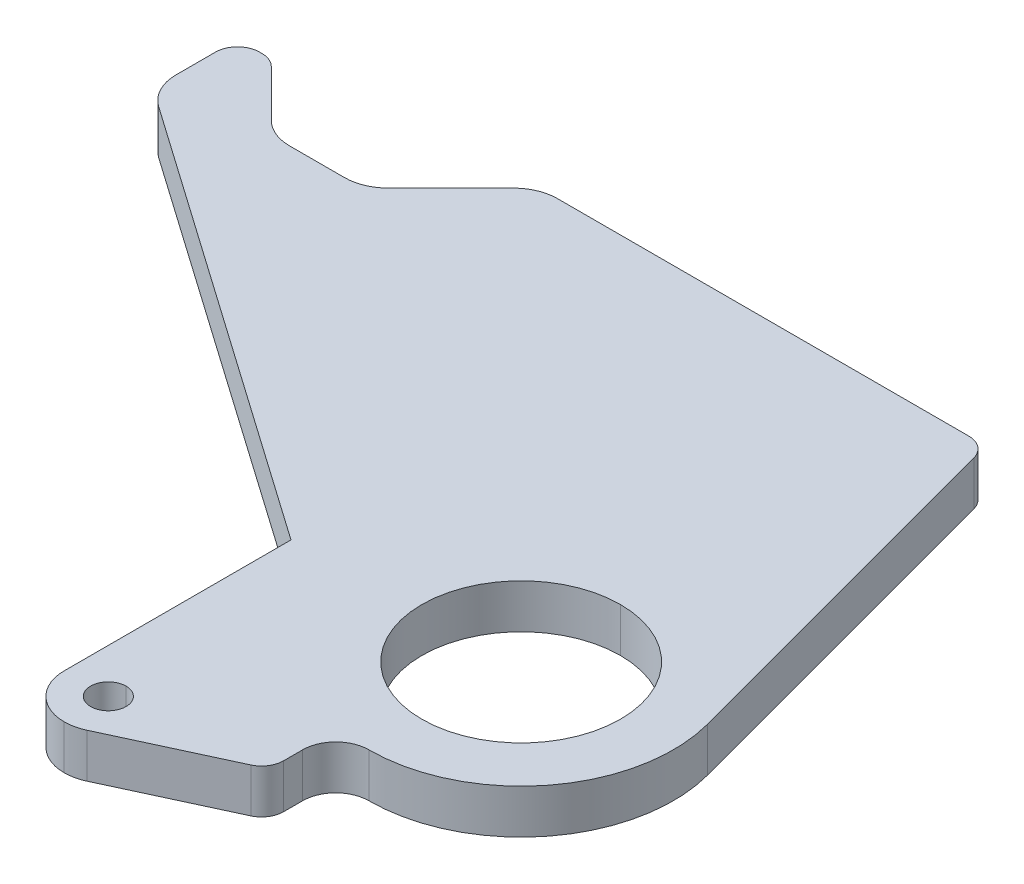
ISO-10303-21;
HEADER;
FILE_DESCRIPTION(('STEP AP214'),'2;1');
FILE_NAME('part.step','',(''),(''),'','','');
FILE_SCHEMA(('AUTOMOTIVE_DESIGN { 1 0 10303 214 1 1 1 1 }'));
ENDSEC;
DATA;
#1=APPLICATION_CONTEXT('core data for automotive mechanical design processes');
#2=APPLICATION_PROTOCOL_DEFINITION('international standard','automotive_design',2000,#1);
#3=PRODUCT_CONTEXT('',#1,'mechanical');
#4=PRODUCT('Part','Part','',(#3));
#5=PRODUCT_RELATED_PRODUCT_CATEGORY('part','',(#4));
#6=PRODUCT_DEFINITION_FORMATION('','',#4);
#7=PRODUCT_DEFINITION_CONTEXT('part definition',#1,'design');
#8=PRODUCT_DEFINITION('design','',#6,#7);
#9=PRODUCT_DEFINITION_SHAPE('','',#8);
#10=(LENGTH_UNIT() NAMED_UNIT(*) SI_UNIT(.MILLI.,.METRE.));
#11=(NAMED_UNIT(*) PLANE_ANGLE_UNIT() SI_UNIT($,.RADIAN.));
#12=(NAMED_UNIT(*) SI_UNIT($,.STERADIAN.) SOLID_ANGLE_UNIT());
#13=UNCERTAINTY_MEASURE_WITH_UNIT(LENGTH_MEASURE(1.E-05),#10,'distance_accuracy_value','');
#14=(GEOMETRIC_REPRESENTATION_CONTEXT(3) GLOBAL_UNCERTAINTY_ASSIGNED_CONTEXT((#13)) GLOBAL_UNIT_ASSIGNED_CONTEXT((#10,
#11,#12)) REPRESENTATION_CONTEXT('',''));
#15=CARTESIAN_POINT('',(0.,0.,0.));
#16=DIRECTION('',(0.,0.,1.));
#17=DIRECTION('',(1.,0.,0.));
#18=AXIS2_PLACEMENT_3D('',#15,#16,#17);
#19=CARTESIAN_POINT('',(-90.6567302270047,-6.35,8.78766007566826));
#20=DIRECTION('',(0.707106781186548,0.,-0.707106781186548));
#21=DIRECTION('',(0.,-1.,0.));
#22=AXIS2_PLACEMENT_3D('',#19,#20,#21);
#23=PLANE('',#22);
#24=DIRECTION('',(-0.707106781186548,0.,-0.707106781186548));
#25=VECTOR('',#24,1.);
#26=CARTESIAN_POINT('',(-90.6567302270047,0.,8.78766007566826));
#27=LINE('',#26,#25);
#28=CARTESIAN_POINT('',(-85.4292622421383,0.,14.0151280605346));
#29=VERTEX_POINT('',#28);
#30=CARTESIAN_POINT('',(-92.1644543329402,0.,7.2799359697327));
#31=VERTEX_POINT('',#30);
#32=EDGE_CURVE('E324',#29,#31,#27,.T.);
#33=ORIENTED_EDGE('',*,*,#32,.F.);
#34=DIRECTION('',(0.,-1.,0.));
#35=VECTOR('',#34,1.);
#36=CARTESIAN_POINT('',(-85.4292622421383,-6.35,14.0151280605346));
#37=LINE('',#36,#35);
#38=CARTESIAN_POINT('',(-85.4292622421383,-6.35,14.0151280605346));
#39=VERTEX_POINT('',#38);
#40=EDGE_CURVE('E351',#29,#39,#37,.T.);
#41=ORIENTED_EDGE('',*,*,#40,.T.);
#42=DIRECTION('',(-0.707106781186548,0.,-0.707106781186548));
#43=VECTOR('',#42,1.);
#44=CARTESIAN_POINT('',(-90.6567302270047,-6.35,8.78766007566826));
#45=LINE('',#44,#43);
#46=CARTESIAN_POINT('',(-92.1644543329402,-6.35,7.2799359697327));
#47=VERTEX_POINT('',#46);
#48=EDGE_CURVE('E221',#39,#47,#45,.T.);
#49=ORIENTED_EDGE('',*,*,#48,.T.);
#50=DIRECTION('',(0.,1.,0.));
#51=VECTOR('',#50,1.);
#52=CARTESIAN_POINT('',(-92.1644543329402,-6.35,7.2799359697327));
#53=LINE('',#52,#51);
#54=EDGE_CURVE('E473',#47,#31,#53,.T.);
#55=ORIENTED_EDGE('',*,*,#54,.T.);
#56=EDGE_LOOP('',(#33,#41,#49,#55));
#57=FACE_BOUND('',#56,.T.);
#58=ADVANCED_FACE('F17',(#57),#23,.T.);
#59=CARTESIAN_POINT('',(-80.2815701513364,-6.35,15.875));
#60=DIRECTION('',(0.,0.,-1.));
#61=DIRECTION('',(0.,-1.,0.));
#62=AXIS2_PLACEMENT_3D('',#59,#60,#61);
#63=PLANE('',#62);
#64=DIRECTION('',(-1.,0.,0.));
#65=VECTOR('',#64,1.);
#66=CARTESIAN_POINT('',(-80.2815701513364,-6.35,15.875));
#67=LINE('',#66,#65);
#68=CARTESIAN_POINT('',(-73.0483658183963,-6.35,15.875));
#69=VERTEX_POINT('',#68);
#70=CARTESIAN_POINT('',(-80.9391341816037,-6.35,15.875));
#71=VERTEX_POINT('',#70);
#72=EDGE_CURVE('E238',#69,#71,#67,.T.);
#73=ORIENTED_EDGE('',*,*,#72,.T.);
#74=DIRECTION('',(0.,1.,0.));
#75=VECTOR('',#74,1.);
#76=CARTESIAN_POINT('',(-80.9391341816037,0.,15.875));
#77=LINE('',#76,#75);
#78=CARTESIAN_POINT('',(-80.9391341816037,0.,15.875));
#79=VERTEX_POINT('',#78);
#80=EDGE_CURVE('E350',#71,#79,#77,.T.);
#81=ORIENTED_EDGE('',*,*,#80,.T.);
#82=DIRECTION('',(-1.,0.,0.));
#83=VECTOR('',#82,1.);
#84=CARTESIAN_POINT('',(-80.2815701513364,0.,15.875));
#85=LINE('',#84,#83);
#86=CARTESIAN_POINT('',(-73.0483658183963,0.,15.875));
#87=VERTEX_POINT('',#86);
#88=EDGE_CURVE('E320',#87,#79,#85,.T.);
#89=ORIENTED_EDGE('',*,*,#88,.F.);
#90=DIRECTION('',(0.,-1.,0.));
#91=VECTOR('',#90,1.);
#92=CARTESIAN_POINT('',(-73.0483658183963,-6.35,15.875));
#93=LINE('',#92,#91);
#94=EDGE_CURVE('E357',#87,#69,#93,.T.);
#95=ORIENTED_EDGE('',*,*,#94,.T.);
#96=EDGE_LOOP('',(#73,#81,#89,#95));
#97=FACE_BOUND('',#96,.T.);
#98=ADVANCED_FACE('F564',(#97),#63,.T.);
#99=CARTESIAN_POINT('',(-68.0932697729954,-6.35,13.5501600756682));
#100=DIRECTION('',(0.707106781186548,0.,0.707106781186547));
#101=DIRECTION('',(0.,-1.,0.));
#102=AXIS2_PLACEMENT_3D('',#99,#100,#101);
#103=PLANE('',#102);
#104=DIRECTION('',(0.707106781186547,0.,-0.707106781186548));
#105=VECTOR('',#104,1.);
#106=CARTESIAN_POINT('',(-68.0932697729954,0.,13.5501600756682));
#107=LINE('',#106,#105);
#108=CARTESIAN_POINT('',(-68.5582377578617,0.,14.0151280605346));
#109=VERTEX_POINT('',#108);
#110=CARTESIAN_POINT('',(-59.5779816367926,0.,5.03487193946542));
#111=VERTEX_POINT('',#110);
#112=EDGE_CURVE('E325',#109,#111,#107,.T.);
#113=ORIENTED_EDGE('',*,*,#112,.T.);
#114=DIRECTION('',(0.,-1.,0.));
#115=VECTOR('',#114,1.);
#116=CARTESIAN_POINT('',(-59.5779816367926,-6.35,5.03487193946542));
#117=LINE('',#116,#115);
#118=CARTESIAN_POINT('',(-59.5779816367926,-6.35,5.03487193946542));
#119=VERTEX_POINT('',#118);
#120=EDGE_CURVE('E417',#111,#119,#117,.T.);
#121=ORIENTED_EDGE('',*,*,#120,.T.);
#122=DIRECTION('',(0.707106781186547,0.,-0.707106781186548));
#123=VECTOR('',#122,1.);
#124=CARTESIAN_POINT('',(-68.0932697729954,-6.35,13.5501600756682));
#125=LINE('',#124,#123);
#126=CARTESIAN_POINT('',(-68.5582377578617,-6.35,14.0151280605346));
#127=VERTEX_POINT('',#126);
#128=EDGE_CURVE('E204',#127,#119,#125,.T.);
#129=ORIENTED_EDGE('',*,*,#128,.F.);
#130=DIRECTION('',(0.,1.,0.));
#131=VECTOR('',#130,1.);
#132=CARTESIAN_POINT('',(-68.5582377578617,-6.35,14.0151280605346));
#133=LINE('',#132,#131);
#134=EDGE_CURVE('E356',#127,#109,#133,.T.);
#135=ORIENTED_EDGE('',*,*,#134,.T.);
#136=EDGE_LOOP('',(#113,#121,#129,#135));
#137=FACE_BOUND('',#136,.T.);
#138=ADVANCED_FACE('F528',(#137),#103,.F.);
#139=CARTESIAN_POINT('',(-25.6009159042003,-6.35,3.175));
#140=DIRECTION('',(0.,0.,-1.));
#141=DIRECTION('',(0.,-1.,0.));
#142=AXIS2_PLACEMENT_3D('',#139,#140,#141);
#143=PLANE('',#142);
#144=DIRECTION('',(-1.,0.,0.));
#145=VECTOR('',#144,1.);
#146=CARTESIAN_POINT('',(-25.6009159042003,-6.35,3.175));
#147=LINE('',#146,#145);
#148=CARTESIAN_POINT('',(4.08001470209326,-6.35,3.175));
#149=VERTEX_POINT('',#148);
#150=CARTESIAN_POINT('',(-55.087853576258,-6.35,3.175));
#151=VERTEX_POINT('',#150);
#152=EDGE_CURVE('E271',#149,#151,#147,.T.);
#153=ORIENTED_EDGE('',*,*,#152,.T.);
#154=DIRECTION('',(0.,1.,0.));
#155=VECTOR('',#154,1.);
#156=CARTESIAN_POINT('',(-55.087853576258,0.,3.175));
#157=LINE('',#156,#155);
#158=CARTESIAN_POINT('',(-55.087853576258,0.,3.175));
#159=VERTEX_POINT('',#158);
#160=EDGE_CURVE('E424',#151,#159,#157,.T.);
#161=ORIENTED_EDGE('',*,*,#160,.T.);
#162=DIRECTION('',(-1.,0.,0.));
#163=VECTOR('',#162,1.);
#164=CARTESIAN_POINT('',(-25.6009159042003,0.,3.175));
#165=LINE('',#164,#163);
#166=CARTESIAN_POINT('',(4.08001470209326,0.,3.175));
#167=VERTEX_POINT('',#166);
#168=EDGE_CURVE('E477',#167,#159,#165,.T.);
#169=ORIENTED_EDGE('',*,*,#168,.F.);
#170=DIRECTION('',(0.,-1.,0.));
#171=VECTOR('',#170,1.);
#172=CARTESIAN_POINT('',(4.08001470209326,-6.35,3.175));
#173=LINE('',#172,#171);
#174=EDGE_CURVE('E430',#167,#149,#173,.T.);
#175=ORIENTED_EDGE('',*,*,#174,.T.);
#176=EDGE_LOOP('',(#153,#161,#169,#175));
#177=FACE_BOUND('',#176,.T.);
#178=ADVANCED_FACE('F523',(#177),#143,.T.);
#179=CARTESIAN_POINT('',(13.8386489641771,-6.35,30.5024608847082));
#180=DIRECTION('',(0.965925826289069,0.,-0.25881904510252));
#181=DIRECTION('',(0.,-1.,0.));
#182=AXIS2_PLACEMENT_3D('',#179,#180,#181);
#183=PLANE('',#182);
#184=DIRECTION('',(-0.25881904510252,0.,-0.965925826289069));
#185=VECTOR('',#184,1.);
#186=CARTESIAN_POINT('',(13.8386489641771,-6.35,30.5024608847082));
#187=LINE('',#186,#185);
#188=CARTESIAN_POINT('',(21.1610200394278,-6.35,57.8299217694165));
#189=VERTEX_POINT('',#188);
#190=CARTESIAN_POINT('',(7.14682920056105,-6.35,5.5282495317995));
#191=VERTEX_POINT('',#190);
#192=EDGE_CURVE('E201',#189,#191,#187,.T.);
#193=ORIENTED_EDGE('',*,*,#192,.T.);
#194=DIRECTION('',(0.,1.,0.));
#195=VECTOR('',#194,1.);
#196=CARTESIAN_POINT('',(7.14682920056105,-6.35,5.5282495317995));
#197=LINE('',#196,#195);
#198=CARTESIAN_POINT('',(7.14682920056105,0.,5.5282495317995));
#199=VERTEX_POINT('',#198);
#200=EDGE_CURVE('E438',#191,#199,#197,.T.);
#201=ORIENTED_EDGE('',*,*,#200,.T.);
#202=DIRECTION('',(-0.25881904510252,0.,-0.965925826289069));
#203=VECTOR('',#202,1.);
#204=CARTESIAN_POINT('',(13.8386489641771,0.,30.5024608847082));
#205=LINE('',#204,#203);
#206=CARTESIAN_POINT('',(21.1610200394278,0.,57.8299217694165));
#207=VERTEX_POINT('',#206);
#208=EDGE_CURVE('E254',#207,#199,#205,.T.);
#209=ORIENTED_EDGE('',*,*,#208,.F.);
#210=DIRECTION('',(0.,1.,0.));
#211=VECTOR('',#210,1.);
#212=CARTESIAN_POINT('',(21.1610200394278,-6.35,57.8299217694165));
#213=LINE('',#212,#211);
#214=EDGE_CURVE('E11',#189,#207,#213,.T.);
#215=ORIENTED_EDGE('',*,*,#214,.F.);
#216=EDGE_LOOP('',(#193,#201,#209,#215));
#217=FACE_BOUND('',#216,.T.);
#218=ADVANCED_FACE('F513',(#217),#183,.T.);
#219=CARTESIAN_POINT('',(0.,-6.35,63.5));
#220=DIRECTION('',(0.,1.,0.));
#221=DIRECTION('',(0.,0.,1.));
#222=AXIS2_PLACEMENT_3D('',#219,#220,#221);
#223=CYLINDRICAL_SURFACE('',#222,21.9075);
#224=CARTESIAN_POINT('',(0.,0.,63.5));
#225=DIRECTION('',(0.,-1.,0.));
#226=DIRECTION('',(0.,0.,-1.));
#227=AXIS2_PLACEMENT_3D('',#224,#225,#226);
#228=CIRCLE('',#227,21.9075);
#229=CARTESIAN_POINT('',(0.,0.,85.4075));
#230=VERTEX_POINT('',#229);
#231=EDGE_CURVE('E258',#207,#230,#228,.T.);
#232=ORIENTED_EDGE('',*,*,#231,.T.);
#233=DIRECTION('',(0.,1.,0.));
#234=VECTOR('',#233,1.);
#235=CARTESIAN_POINT('',(0.,-6.35,85.4075));
#236=LINE('',#235,#234);
#237=CARTESIAN_POINT('',(0.,-6.35,85.4075));
#238=VERTEX_POINT('',#237);
#239=EDGE_CURVE('E27',#238,#230,#236,.T.);
#240=ORIENTED_EDGE('',*,*,#239,.F.);
#241=CARTESIAN_POINT('',(0.,-6.35,63.5));
#242=DIRECTION('',(0.,-1.,0.));
#243=DIRECTION('',(0.,0.,-1.));
#244=AXIS2_PLACEMENT_3D('',#241,#242,#243);
#245=CIRCLE('',#244,21.9075);
#246=EDGE_CURVE('E194',#189,#238,#245,.T.);
#247=ORIENTED_EDGE('',*,*,#246,.F.);
#248=ORIENTED_EDGE('',*,*,#214,.T.);
#249=EDGE_LOOP('',(#232,#240,#247,#248));
#250=FACE_BOUND('',#249,.T.);
#251=ADVANCED_FACE('F511',(#250),#223,.T.);
#252=CARTESIAN_POINT('',(0.,-6.35,90.17));
#253=DIRECTION('',(0.,1.,0.));
#254=DIRECTION('',(0.,0.,1.));
#255=AXIS2_PLACEMENT_3D('',#252,#253,#254);
#256=CYLINDRICAL_SURFACE('',#255,4.7625);
#257=CARTESIAN_POINT('',(0.,0.,90.17));
#258=DIRECTION('',(0.,-1.,0.));
#259=DIRECTION('',(0.,0.,-1.));
#260=AXIS2_PLACEMENT_3D('',#257,#258,#259);
#261=CIRCLE('',#260,4.7625);
#262=CARTESIAN_POINT('',(-4.7625,0.,90.17));
#263=VERTEX_POINT('',#262);
#264=EDGE_CURVE('E175',#263,#230,#261,.T.);
#265=ORIENTED_EDGE('',*,*,#264,.F.);
#266=DIRECTION('',(0.,1.,0.));
#267=VECTOR('',#266,1.);
#268=CARTESIAN_POINT('',(-4.7625,-6.35,90.17));
#269=LINE('',#268,#267);
#270=CARTESIAN_POINT('',(-4.7625,-6.35,90.17));
#271=VERTEX_POINT('',#270);
#272=EDGE_CURVE('E20',#271,#263,#269,.T.);
#273=ORIENTED_EDGE('',*,*,#272,.F.);
#274=CARTESIAN_POINT('',(0.,-6.35,90.17));
#275=DIRECTION('',(0.,-1.,0.));
#276=DIRECTION('',(0.,0.,-1.));
#277=AXIS2_PLACEMENT_3D('',#274,#275,#276);
#278=CIRCLE('',#277,4.7625);
#279=EDGE_CURVE('E172',#271,#238,#278,.T.);
#280=ORIENTED_EDGE('',*,*,#279,.T.);
#281=ORIENTED_EDGE('',*,*,#239,.T.);
#282=EDGE_LOOP('',(#265,#273,#280,#281));
#283=FACE_BOUND('',#282,.T.);
#284=ADVANCED_FACE('F170',(#283),#256,.F.);
#285=CARTESIAN_POINT('',(-4.7625,-6.35,92.55125));
#286=DIRECTION('',(1.,0.,0.));
#287=DIRECTION('',(0.,0.,1.));
#288=AXIS2_PLACEMENT_3D('',#285,#286,#287);
#289=PLANE('',#288);
#290=DIRECTION('',(0.,0.,-1.));
#291=VECTOR('',#290,1.);
#292=CARTESIAN_POINT('',(-4.7625,0.,92.55125));
#293=LINE('',#292,#291);
#294=CARTESIAN_POINT('',(-4.7625,0.,92.9032270908187));
#295=VERTEX_POINT('',#294);
#296=EDGE_CURVE('E499',#295,#263,#293,.T.);
#297=ORIENTED_EDGE('',*,*,#296,.F.);
#298=DIRECTION('',(0.,-1.,0.));
#299=VECTOR('',#298,1.);
#300=CARTESIAN_POINT('',(-4.7625,-6.35,92.9032270908187));
#301=LINE('',#300,#299);
#302=CARTESIAN_POINT('',(-4.7625,-6.35,92.9032270908187));
#303=VERTEX_POINT('',#302);
#304=EDGE_CURVE('E184',#295,#303,#301,.T.);
#305=ORIENTED_EDGE('',*,*,#304,.T.);
#306=DIRECTION('',(0.,0.,-1.));
#307=VECTOR('',#306,1.);
#308=CARTESIAN_POINT('',(-4.7625,-6.35,92.55125));
#309=LINE('',#308,#307);
#310=EDGE_CURVE('E181',#303,#271,#309,.T.);
#311=ORIENTED_EDGE('',*,*,#310,.T.);
#312=ORIENTED_EDGE('',*,*,#272,.T.);
#313=EDGE_LOOP('',(#297,#305,#311,#312));
#314=FACE_BOUND('',#313,.T.);
#315=ADVANCED_FACE('F182',(#314),#289,.T.);
#316=CARTESIAN_POINT('',(-13.7479119919635,-6.35,99.09031399532));
#317=DIRECTION('',(-0.419948978909134,0.,-0.907547715061404));
#318=DIRECTION('',(-0.907547715061404,0.,0.419948978909134));
#319=AXIS2_PLACEMENT_3D('',#316,#317,#318);
#320=PLANE('',#319);
#321=DIRECTION('',(-0.907547715061404,0.,0.419948978909134));
#322=VECTOR('',#321,1.);
#323=CARTESIAN_POINT('',(-13.7479119919635,-6.35,99.09031399532));
#324=LINE('',#323,#322);
#325=CARTESIAN_POINT('',(-6.6041619919635,-6.35,95.7846910861387));
#326=VERTEX_POINT('',#325);
#327=CARTESIAN_POINT('',(-22.733323983927,-6.35,103.24812799064));
#328=VERTEX_POINT('',#327);
#329=EDGE_CURVE('E189',#326,#328,#324,.T.);
#330=ORIENTED_EDGE('',*,*,#329,.F.);
#331=DIRECTION('',(0.,1.,0.));
#332=VECTOR('',#331,1.);
#333=CARTESIAN_POINT('',(-6.6041619919635,0.,95.7846910861387));
#334=LINE('',#333,#332);
#335=CARTESIAN_POINT('',(-6.6041619919635,0.,95.7846910861387));
#336=VERTEX_POINT('',#335);
#337=EDGE_CURVE('E453',#326,#336,#334,.T.);
#338=ORIENTED_EDGE('',*,*,#337,.T.);
#339=DIRECTION('',(-0.907547715061404,0.,0.419948978909134));
#340=VECTOR('',#339,1.);
#341=CARTESIAN_POINT('',(-13.7479119919635,0.,99.09031399532));
#342=LINE('',#341,#340);
#343=CARTESIAN_POINT('',(-22.733323983927,0.,103.24812799064));
#344=VERTEX_POINT('',#343);
#345=EDGE_CURVE('E496',#336,#344,#342,.T.);
#346=ORIENTED_EDGE('',*,*,#345,.T.);
#347=DIRECTION('',(0.,1.,0.));
#348=VECTOR('',#347,1.);
#349=CARTESIAN_POINT('',(-22.733323983927,-6.35,103.24812799064));
#350=LINE('',#349,#348);
#351=EDGE_CURVE('E179',#328,#344,#350,.T.);
#352=ORIENTED_EDGE('',*,*,#351,.F.);
#353=EDGE_LOOP('',(#330,#338,#346,#352));
#354=FACE_BOUND('',#353,.T.);
#355=ADVANCED_FACE('F732',(#354),#320,.F.);
#356=CARTESIAN_POINT('',(-25.4,-6.35,97.4852));
#357=DIRECTION('',(0.,1.,0.));
#358=DIRECTION('',(0.,0.,1.));
#359=AXIS2_PLACEMENT_3D('',#356,#357,#358);
#360=CYLINDRICAL_SURFACE('',#359,6.35);
#361=DIRECTION('',(0.,1.,0.));
#362=VECTOR('',#361,1.);
#363=CARTESIAN_POINT('',(-25.4,-6.35,103.8352));
#364=LINE('',#363,#362);
#365=CARTESIAN_POINT('',(-25.4,-6.35,103.8352));
#366=VERTEX_POINT('',#365);
#367=CARTESIAN_POINT('',(-25.4,0.,103.8352));
#368=VERTEX_POINT('',#367);
#369=EDGE_CURVE('E301',#366,#368,#364,.T.);
#370=ORIENTED_EDGE('',*,*,#369,.F.);
#371=CARTESIAN_POINT('',(-25.4,-6.35,97.4852));
#372=DIRECTION('',(0.,-1.,0.));
#373=DIRECTION('',(0.,0.,-1.));
#374=AXIS2_PLACEMENT_3D('',#371,#372,#373);
#375=CIRCLE('',#374,6.35);
#376=EDGE_CURVE('E210',#328,#366,#375,.T.);
#377=ORIENTED_EDGE('',*,*,#376,.F.);
#378=ORIENTED_EDGE('',*,*,#351,.T.);
#379=CARTESIAN_POINT('',(-25.4,0.,97.4852));
#380=DIRECTION('',(0.,-1.,0.));
#381=DIRECTION('',(0.,0.,-1.));
#382=AXIS2_PLACEMENT_3D('',#379,#380,#381);
#383=CIRCLE('',#382,6.35);
#384=EDGE_CURVE('E294',#344,#368,#383,.T.);
#385=ORIENTED_EDGE('',*,*,#384,.T.);
#386=EDGE_LOOP('',(#370,#377,#378,#385));
#387=FACE_BOUND('',#386,.T.);
#388=ADVANCED_FACE('F742',(#387),#360,.T.);
#389=CARTESIAN_POINT('',(-31.75,-6.35,81.1722638576814));
#390=DIRECTION('',(1.,0.,0.));
#391=DIRECTION('',(0.,0.,1.));
#392=AXIS2_PLACEMENT_3D('',#389,#390,#391);
#393=PLANE('',#392);
#394=DIRECTION('',(0.,0.,-1.));
#395=VECTOR('',#394,1.);
#396=CARTESIAN_POINT('',(-31.75,0.,81.1722638576814));
#397=LINE('',#396,#395);
#398=CARTESIAN_POINT('',(-31.75,0.,97.4852));
#399=VERTEX_POINT('',#398);
#400=CARTESIAN_POINT('',(-31.75,0.,64.8593277153627));
#401=VERTEX_POINT('',#400);
#402=EDGE_CURVE('E291',#399,#401,#397,.T.);
#403=ORIENTED_EDGE('',*,*,#402,.T.);
#404=DIRECTION('',(0.,1.,0.));
#405=VECTOR('',#404,1.);
#406=CARTESIAN_POINT('',(-31.75,-6.35,64.8593277153627));
#407=LINE('',#406,#405);
#408=CARTESIAN_POINT('',(-31.75,-6.35,64.8593277153627));
#409=VERTEX_POINT('',#408);
#410=EDGE_CURVE('E41',#409,#401,#407,.T.);
#411=ORIENTED_EDGE('',*,*,#410,.F.);
#412=DIRECTION('',(0.,0.,-1.));
#413=VECTOR('',#412,1.);
#414=CARTESIAN_POINT('',(-31.75,-6.35,81.1722638576814));
#415=LINE('',#414,#413);
#416=CARTESIAN_POINT('',(-31.75,-6.35,97.4852));
#417=VERTEX_POINT('',#416);
#418=EDGE_CURVE('E214',#417,#409,#415,.T.);
#419=ORIENTED_EDGE('',*,*,#418,.F.);
#420=DIRECTION('',(0.,1.,0.));
#421=VECTOR('',#420,1.);
#422=CARTESIAN_POINT('',(-31.75,-6.35,97.4852));
#423=LINE('',#422,#421);
#424=EDGE_CURVE('E300',#417,#399,#423,.T.);
#425=ORIENTED_EDGE('',*,*,#424,.T.);
#426=EDGE_LOOP('',(#403,#411,#419,#425));
#427=FACE_BOUND('',#426,.T.);
#428=ADVANCED_FACE('F753',(#427),#393,.F.);
#429=CARTESIAN_POINT('',(-64.849375,-6.35,41.6828958303327));
#430=DIRECTION('',(-0.573576436351047,0.,0.819152044288992));
#431=DIRECTION('',(0.,1.,0.));
#432=AXIS2_PLACEMENT_3D('',#429,#430,#431);
#433=PLANE('',#432);
#434=DIRECTION('',(0.819152044288992,0.,0.573576436351047));
#435=VECTOR('',#434,1.);
#436=CARTESIAN_POINT('',(-64.849375,0.,41.6828958303327));
#437=LINE('',#436,#435);
#438=CARTESIAN_POINT('',(-95.2409603708292,0.,20.4024786555341));
#439=VERTEX_POINT('',#438);
#440=EDGE_CURVE('E295',#439,#401,#437,.T.);
#441=ORIENTED_EDGE('',*,*,#440,.F.);
#442=DIRECTION('',(0.,-1.,0.));
#443=VECTOR('',#442,1.);
#444=CARTESIAN_POINT('',(-95.2409603708292,-6.35,20.4024786555341));
#445=LINE('',#444,#443);
#446=CARTESIAN_POINT('',(-95.2409603708292,-6.35,20.4024786555341));
#447=VERTEX_POINT('',#446);
#448=EDGE_CURVE('E406',#439,#447,#445,.T.);
#449=ORIENTED_EDGE('',*,*,#448,.T.);
#450=DIRECTION('',(0.819152044288992,0.,0.573576436351047));
#451=VECTOR('',#450,1.);
#452=CARTESIAN_POINT('',(-64.849375,-6.35,41.6828958303327));
#453=LINE('',#452,#451);
#454=EDGE_CURVE('E215',#447,#409,#453,.T.);
#455=ORIENTED_EDGE('',*,*,#454,.T.);
#456=ORIENTED_EDGE('',*,*,#410,.T.);
#457=EDGE_LOOP('',(#441,#449,#455,#456));
#458=FACE_BOUND('',#457,.T.);
#459=ADVANCED_FACE('F764',(#458),#433,.T.);
#460=CARTESIAN_POINT('',(-97.94875,-6.35,12.4282319726513));
#461=DIRECTION('',(-1.,0.,0.));
#462=DIRECTION('',(0.,0.,1.));
#463=AXIS2_PLACEMENT_3D('',#460,#461,#462);
#464=PLANE('',#463);
#465=DIRECTION('',(0.,0.,1.));
#466=VECTOR('',#465,1.);
#467=CARTESIAN_POINT('',(-97.94875,-6.35,12.4282319726513));
#468=LINE('',#467,#466);
#469=CARTESIAN_POINT('',(-97.94875,-6.35,9.525));
#470=VERTEX_POINT('',#469);
#471=CARTESIAN_POINT('',(-97.94875,-6.35,15.2008631742991));
#472=VERTEX_POINT('',#471);
#473=EDGE_CURVE('E218',#470,#472,#468,.T.);
#474=ORIENTED_EDGE('',*,*,#473,.T.);
#475=DIRECTION('',(0.,1.,0.));
#476=VECTOR('',#475,1.);
#477=CARTESIAN_POINT('',(-97.94875,-6.35,15.2008631742991));
#478=LINE('',#477,#476);
#479=CARTESIAN_POINT('',(-97.94875,0.,15.2008631742991));
#480=VERTEX_POINT('',#479);
#481=EDGE_CURVE('E311',#472,#480,#478,.T.);
#482=ORIENTED_EDGE('',*,*,#481,.T.);
#483=DIRECTION('',(0.,0.,1.));
#484=VECTOR('',#483,1.);
#485=CARTESIAN_POINT('',(-97.94875,0.,12.4282319726513));
#486=LINE('',#485,#484);
#487=CARTESIAN_POINT('',(-97.94875,0.,9.525));
#488=VERTEX_POINT('',#487);
#489=EDGE_CURVE('E487',#488,#480,#486,.T.);
#490=ORIENTED_EDGE('',*,*,#489,.F.);
#491=DIRECTION('',(0.,-1.,0.));
#492=VECTOR('',#491,1.);
#493=CARTESIAN_POINT('',(-97.94875,-6.35,9.525));
#494=LINE('',#493,#492);
#495=EDGE_CURVE('E395',#488,#470,#494,.T.);
#496=ORIENTED_EDGE('',*,*,#495,.T.);
#497=EDGE_LOOP('',(#474,#482,#490,#496));
#498=FACE_BOUND('',#497,.T.);
#499=ADVANCED_FACE('F774',(#498),#464,.T.);
#500=CARTESIAN_POINT('',(0.,-6.35,63.5));
#501=DIRECTION('',(0.,1.,0.));
#502=DIRECTION('',(0.,0.,1.));
#503=AXIS2_PLACEMENT_3D('',#500,#501,#502);
#504=CYLINDRICAL_SURFACE('',#503,14.2875);
#505=DIRECTION('',(0.,1.,0.));
#506=VECTOR('',#505,1.);
#507=CARTESIAN_POINT('',(0.,-6.35,49.2125));
#508=LINE('',#507,#506);
#509=CARTESIAN_POINT('',(0.,-6.35,49.2125));
#510=VERTEX_POINT('',#509);
#511=CARTESIAN_POINT('',(0.,0.,49.2125));
#512=VERTEX_POINT('',#511);
#513=EDGE_CURVE('E290',#510,#512,#508,.T.);
#514=ORIENTED_EDGE('',*,*,#513,.F.);
#515=CARTESIAN_POINT('',(0.,-6.35,63.5));
#516=DIRECTION('',(0.,-1.,0.));
#517=DIRECTION('',(0.,0.,-1.));
#518=AXIS2_PLACEMENT_3D('',#515,#516,#517);
#519=CIRCLE('',#518,14.2875);
#520=CARTESIAN_POINT('',(0.,-6.35,77.7875));
#521=VERTEX_POINT('',#520);
#522=EDGE_CURVE('E222',#510,#521,#519,.T.);
#523=ORIENTED_EDGE('',*,*,#522,.T.);
#524=DIRECTION('',(0.,1.,0.));
#525=VECTOR('',#524,1.);
#526=CARTESIAN_POINT('',(0.,-6.35,77.7875));
#527=LINE('',#526,#525);
#528=CARTESIAN_POINT('',(0.,0.,77.7875));
#529=VERTEX_POINT('',#528);
#530=EDGE_CURVE('E339',#521,#529,#527,.T.);
#531=ORIENTED_EDGE('',*,*,#530,.T.);
#532=CARTESIAN_POINT('',(0.,0.,63.5));
#533=DIRECTION('',(0.,-1.,0.));
#534=DIRECTION('',(0.,0.,-1.));
#535=AXIS2_PLACEMENT_3D('',#532,#533,#534);
#536=CIRCLE('',#535,14.2875);
#537=EDGE_CURVE('E261',#512,#529,#536,.T.);
#538=ORIENTED_EDGE('',*,*,#537,.F.);
#539=EDGE_LOOP('',(#514,#523,#531,#538));
#540=FACE_BOUND('',#539,.T.);
#541=ADVANCED_FACE('F785',(#540),#504,.F.);
#542=CARTESIAN_POINT('',(-95.5215701513364,-6.35,6.35));
#543=DIRECTION('',(0.,0.,-1.));
#544=DIRECTION('',(-1.,0.,0.));
#545=AXIS2_PLACEMENT_3D('',#542,#543,#544);
#546=PLANE('',#545);
#547=DIRECTION('',(-1.,0.,0.));
#548=VECTOR('',#547,1.);
#549=CARTESIAN_POINT('',(-95.5215701513364,0.,6.35));
#550=LINE('',#549,#548);
#551=CARTESIAN_POINT('',(-94.4095183632075,0.,6.35));
#552=VERTEX_POINT('',#551);
#553=CARTESIAN_POINT('',(-94.77375,0.,6.35));
#554=VERTEX_POINT('',#553);
#555=EDGE_CURVE('E484',#552,#554,#550,.T.);
#556=ORIENTED_EDGE('',*,*,#555,.F.);
#557=DIRECTION('',(0.,-1.,0.));
#558=VECTOR('',#557,1.);
#559=CARTESIAN_POINT('',(-94.4095183632075,-6.35,6.35));
#560=LINE('',#559,#558);
#561=CARTESIAN_POINT('',(-94.4095183632075,-6.35,6.35));
#562=VERTEX_POINT('',#561);
#563=EDGE_CURVE('E330',#552,#562,#560,.T.);
#564=ORIENTED_EDGE('',*,*,#563,.T.);
#565=DIRECTION('',(-1.,0.,0.));
#566=VECTOR('',#565,1.);
#567=CARTESIAN_POINT('',(-95.5215701513364,-6.35,6.35));
#568=LINE('',#567,#566);
#569=CARTESIAN_POINT('',(-94.77375,-6.35,6.35));
#570=VERTEX_POINT('',#569);
#571=EDGE_CURVE('E219',#562,#570,#568,.T.);
#572=ORIENTED_EDGE('',*,*,#571,.T.);
#573=DIRECTION('',(0.,1.,0.));
#574=VECTOR('',#573,1.);
#575=CARTESIAN_POINT('',(-94.77375,-6.35,6.35));
#576=LINE('',#575,#574);
#577=EDGE_CURVE('E394',#570,#554,#576,.T.);
#578=ORIENTED_EDGE('',*,*,#577,.T.);
#579=EDGE_LOOP('',(#556,#564,#572,#578));
#580=FACE_BOUND('',#579,.T.);
#581=ADVANCED_FACE('F579',(#580),#546,.T.);
#582=CARTESIAN_POINT('',(-25.4,-6.35,97.4852));
#583=DIRECTION('',(0.,1.,0.));
#584=DIRECTION('',(0.,0.,1.));
#585=AXIS2_PLACEMENT_3D('',#582,#583,#584);
#586=CYLINDRICAL_SURFACE('',#585,2.5527);
#587=DIRECTION('',(0.,1.,0.));
#588=VECTOR('',#587,1.);
#589=CARTESIAN_POINT('',(-25.4,-6.35,94.9325));
#590=LINE('',#589,#588);
#591=CARTESIAN_POINT('',(-25.4,-6.35,94.9325));
#592=VERTEX_POINT('',#591);
#593=CARTESIAN_POINT('',(-25.4,0.,94.9325));
#594=VERTEX_POINT('',#593);
#595=EDGE_CURVE('E361',#592,#594,#590,.T.);
#596=ORIENTED_EDGE('',*,*,#595,.F.);
#597=CARTESIAN_POINT('',(-25.4,-6.35,97.4852));
#598=DIRECTION('',(0.,-1.,0.));
#599=DIRECTION('',(0.,0.,-1.));
#600=AXIS2_PLACEMENT_3D('',#597,#598,#599);
#601=CIRCLE('',#600,2.5527);
#602=CARTESIAN_POINT('',(-25.4,-6.35,100.0379));
#603=VERTEX_POINT('',#602);
#604=EDGE_CURVE('E225',#592,#603,#601,.T.);
#605=ORIENTED_EDGE('',*,*,#604,.T.);
#606=DIRECTION('',(0.,1.,0.));
#607=VECTOR('',#606,1.);
#608=CARTESIAN_POINT('',(-25.4,-6.35,100.0379));
#609=LINE('',#608,#607);
#610=CARTESIAN_POINT('',(-25.4,0.,100.0379));
#611=VERTEX_POINT('',#610);
#612=EDGE_CURVE('E373',#603,#611,#609,.T.);
#613=ORIENTED_EDGE('',*,*,#612,.T.);
#614=CARTESIAN_POINT('',(-25.4,0.,97.4852));
#615=DIRECTION('',(0.,-1.,0.));
#616=DIRECTION('',(0.,0.,-1.));
#617=AXIS2_PLACEMENT_3D('',#614,#615,#616);
#618=CIRCLE('',#617,2.5527);
#619=EDGE_CURVE('E257',#594,#611,#618,.T.);
#620=ORIENTED_EDGE('',*,*,#619,.F.);
#621=EDGE_LOOP('',(#596,#605,#613,#620));
#622=FACE_BOUND('',#621,.T.);
#623=ADVANCED_FACE('F802',(#622),#586,.F.);
#624=CARTESIAN_POINT('',(-2.54,-6.35,48.1696344730925));
#625=DIRECTION('',(0.,-1.,0.));
#626=DIRECTION('',(0.,0.,-1.));
#627=AXIS2_PLACEMENT_3D('',#624,#625,#626);
#628=PLANE('',#627);
#629=CARTESIAN_POINT('',(0.,-6.35,63.5));
#630=DIRECTION('',(0.,-1.,0.));
#631=DIRECTION('',(0.,0.,-1.));
#632=AXIS2_PLACEMENT_3D('',#629,#630,#631);
#633=CIRCLE('',#632,14.2875);
#634=EDGE_CURVE('E329',#521,#510,#633,.T.);
#635=ORIENTED_EDGE('',*,*,#634,.F.);
#636=ORIENTED_EDGE('',*,*,#522,.F.);
#637=EDGE_LOOP('',(#635,#636));
#638=FACE_BOUND('',#637,.T.);
#639=CARTESIAN_POINT('',(-25.4,-6.35,97.4852));
#640=DIRECTION('',(0.,-1.,0.));
#641=DIRECTION('',(0.,0.,-1.));
#642=AXIS2_PLACEMENT_3D('',#639,#640,#641);
#643=CIRCLE('',#642,2.5527);
#644=EDGE_CURVE('E342',#603,#592,#643,.T.);
#645=ORIENTED_EDGE('',*,*,#644,.F.);
#646=ORIENTED_EDGE('',*,*,#604,.F.);
#647=EDGE_LOOP('',(#645,#646));
#648=FACE_BOUND('',#647,.T.);
#649=ORIENTED_EDGE('',*,*,#128,.T.);
#650=CARTESIAN_POINT('',(-55.087853576258,-6.35,9.525));
#651=DIRECTION('',(0.,-1.,0.));
#652=DIRECTION('',(0.,0.,-1.));
#653=AXIS2_PLACEMENT_3D('',#650,#651,#652);
#654=CIRCLE('',#653,6.35);
#655=EDGE_CURVE('E315',#119,#151,#654,.T.);
#656=ORIENTED_EDGE('',*,*,#655,.T.);
#657=ORIENTED_EDGE('',*,*,#152,.F.);
#658=CARTESIAN_POINT('',(4.08001470209326,-6.35,6.35));
#659=DIRECTION('',(0.,-1.,0.));
#660=DIRECTION('',(0.,0.,-1.));
#661=AXIS2_PLACEMENT_3D('',#658,#659,#660);
#662=CIRCLE('',#661,3.175);
#663=EDGE_CURVE('E427',#149,#191,#662,.T.);
#664=ORIENTED_EDGE('',*,*,#663,.T.);
#665=ORIENTED_EDGE('',*,*,#192,.F.);
#666=ORIENTED_EDGE('',*,*,#246,.T.);
#667=ORIENTED_EDGE('',*,*,#279,.F.);
#668=ORIENTED_EDGE('',*,*,#310,.F.);
#669=CARTESIAN_POINT('',(-7.9375,-6.35,92.9032270908187));
#670=DIRECTION('',(0.,-1.,0.));
#671=DIRECTION('',(0.,0.,-1.));
#672=AXIS2_PLACEMENT_3D('',#669,#670,#671);
#673=CIRCLE('',#672,3.175);
#674=EDGE_CURVE('E442',#303,#326,#673,.T.);
#675=ORIENTED_EDGE('',*,*,#674,.T.);
#676=ORIENTED_EDGE('',*,*,#329,.T.);
#677=ORIENTED_EDGE('',*,*,#376,.T.);
#678=CARTESIAN_POINT('',(-25.4,-6.35,97.4852));
#679=DIRECTION('',(0.,-1.,0.));
#680=DIRECTION('',(0.,0.,-1.));
#681=AXIS2_PLACEMENT_3D('',#678,#679,#680);
#682=CIRCLE('',#681,6.35);
#683=EDGE_CURVE('E304',#366,#417,#682,.T.);
#684=ORIENTED_EDGE('',*,*,#683,.T.);
#685=ORIENTED_EDGE('',*,*,#418,.T.);
#686=ORIENTED_EDGE('',*,*,#454,.F.);
#687=CARTESIAN_POINT('',(-91.59875,-6.35,15.2008631742991));
#688=DIRECTION('',(0.,-1.,0.));
#689=DIRECTION('',(0.,0.,-1.));
#690=AXIS2_PLACEMENT_3D('',#687,#688,#689);
#691=CIRCLE('',#690,6.35);
#692=EDGE_CURVE('E399',#447,#472,#691,.T.);
#693=ORIENTED_EDGE('',*,*,#692,.T.);
#694=ORIENTED_EDGE('',*,*,#473,.F.);
#695=CARTESIAN_POINT('',(-94.77375,-6.35,9.525));
#696=DIRECTION('',(0.,-1.,0.));
#697=DIRECTION('',(0.,0.,-1.));
#698=AXIS2_PLACEMENT_3D('',#695,#696,#697);
#699=CIRCLE('',#698,3.175);
#700=EDGE_CURVE('E457',#470,#570,#699,.T.);
#701=ORIENTED_EDGE('',*,*,#700,.T.);
#702=ORIENTED_EDGE('',*,*,#571,.F.);
#703=CARTESIAN_POINT('',(-94.4095183632075,-6.35,9.525));
#704=DIRECTION('',(0.,-1.,0.));
#705=DIRECTION('',(0.,0.,-1.));
#706=AXIS2_PLACEMENT_3D('',#703,#704,#705);
#707=CIRCLE('',#706,3.175);
#708=EDGE_CURVE('E335',#562,#47,#707,.T.);
#709=ORIENTED_EDGE('',*,*,#708,.T.);
#710=ORIENTED_EDGE('',*,*,#48,.F.);
#711=CARTESIAN_POINT('',(-80.9391341816037,-6.35,9.525));
#712=DIRECTION('',(0.,1.,0.));
#713=DIRECTION('',(0.,0.,-1.));
#714=AXIS2_PLACEMENT_3D('',#711,#712,#713);
#715=CIRCLE('',#714,6.35);
#716=EDGE_CURVE('E369',#39,#71,#715,.T.);
#717=ORIENTED_EDGE('',*,*,#716,.T.);
#718=ORIENTED_EDGE('',*,*,#72,.F.);
#719=CARTESIAN_POINT('',(-73.0483658183963,-6.35,9.525));
#720=DIRECTION('',(0.,1.,0.));
#721=DIRECTION('',(0.,0.,-1.));
#722=AXIS2_PLACEMENT_3D('',#719,#720,#721);
#723=CIRCLE('',#722,6.35);
#724=EDGE_CURVE('E374',#69,#127,#723,.T.);
#725=ORIENTED_EDGE('',*,*,#724,.T.);
#726=EDGE_LOOP('',(#649,#656,#657,#664,#665,#666,#667,#668,#675,#676,#677,#684,#685,#686,#693,
#694,#701,#702,#709,#710,#717,#718,#725));
#727=FACE_BOUND('',#726,.T.);
#728=ADVANCED_FACE('F191',(#638,#648,#727),#628,.T.);
#729=CARTESIAN_POINT('',(-2.54,0.,48.1696344730925));
#730=DIRECTION('',(0.,-1.,0.));
#731=DIRECTION('',(0.,0.,-1.));
#732=AXIS2_PLACEMENT_3D('',#729,#730,#731);
#733=PLANE('',#732);
#734=CARTESIAN_POINT('',(0.,0.,63.5));
#735=DIRECTION('',(0.,-1.,0.));
#736=DIRECTION('',(0.,0.,-1.));
#737=AXIS2_PLACEMENT_3D('',#734,#735,#736);
#738=CIRCLE('',#737,14.2875);
#739=EDGE_CURVE('E343',#529,#512,#738,.T.);
#740=ORIENTED_EDGE('',*,*,#739,.T.);
#741=ORIENTED_EDGE('',*,*,#537,.T.);
#742=EDGE_LOOP('',(#740,#741));
#743=FACE_BOUND('',#742,.T.);
#744=CARTESIAN_POINT('',(-25.4,0.,97.4852));
#745=DIRECTION('',(0.,-1.,0.));
#746=DIRECTION('',(0.,0.,-1.));
#747=AXIS2_PLACEMENT_3D('',#744,#745,#746);
#748=CIRCLE('',#747,2.5527);
#749=EDGE_CURVE('E365',#611,#594,#748,.T.);
#750=ORIENTED_EDGE('',*,*,#749,.T.);
#751=ORIENTED_EDGE('',*,*,#619,.T.);
#752=EDGE_LOOP('',(#750,#751));
#753=FACE_BOUND('',#752,.T.);
#754=ORIENTED_EDGE('',*,*,#168,.T.);
#755=CARTESIAN_POINT('',(-55.087853576258,0.,9.525));
#756=DIRECTION('',(0.,1.,0.));
#757=DIRECTION('',(0.,0.,-1.));
#758=AXIS2_PLACEMENT_3D('',#755,#756,#757);
#759=CIRCLE('',#758,6.35);
#760=EDGE_CURVE('E420',#159,#111,#759,.T.);
#761=ORIENTED_EDGE('',*,*,#760,.T.);
#762=ORIENTED_EDGE('',*,*,#112,.F.);
#763=CARTESIAN_POINT('',(-73.0483658183963,0.,9.525));
#764=DIRECTION('',(0.,-1.,0.));
#765=DIRECTION('',(0.,0.,-1.));
#766=AXIS2_PLACEMENT_3D('',#763,#764,#765);
#767=CIRCLE('',#766,6.35);
#768=EDGE_CURVE('E352',#109,#87,#767,.T.);
#769=ORIENTED_EDGE('',*,*,#768,.T.);
#770=ORIENTED_EDGE('',*,*,#88,.T.);
#771=CARTESIAN_POINT('',(-80.9391341816037,0.,9.525));
#772=DIRECTION('',(0.,-1.,0.));
#773=DIRECTION('',(0.,0.,-1.));
#774=AXIS2_PLACEMENT_3D('',#771,#772,#773);
#775=CIRCLE('',#774,6.35);
#776=EDGE_CURVE('E346',#79,#29,#775,.T.);
#777=ORIENTED_EDGE('',*,*,#776,.T.);
#778=ORIENTED_EDGE('',*,*,#32,.T.);
#779=CARTESIAN_POINT('',(-94.4095183632075,0.,9.525));
#780=DIRECTION('',(0.,1.,0.));
#781=DIRECTION('',(0.,0.,-1.));
#782=AXIS2_PLACEMENT_3D('',#779,#780,#781);
#783=CIRCLE('',#782,3.175);
#784=EDGE_CURVE('E334',#31,#552,#783,.T.);
#785=ORIENTED_EDGE('',*,*,#784,.T.);
#786=ORIENTED_EDGE('',*,*,#555,.T.);
#787=CARTESIAN_POINT('',(-94.77375,0.,9.525));
#788=DIRECTION('',(0.,1.,0.));
#789=DIRECTION('',(0.,0.,-1.));
#790=AXIS2_PLACEMENT_3D('',#787,#788,#789);
#791=CIRCLE('',#790,3.175);
#792=EDGE_CURVE('E390',#554,#488,#791,.T.);
#793=ORIENTED_EDGE('',*,*,#792,.T.);
#794=ORIENTED_EDGE('',*,*,#489,.T.);
#795=CARTESIAN_POINT('',(-91.59875,0.,15.2008631742991));
#796=DIRECTION('',(0.,1.,0.));
#797=DIRECTION('',(0.,0.,-1.));
#798=AXIS2_PLACEMENT_3D('',#795,#796,#797);
#799=CIRCLE('',#798,6.35);
#800=EDGE_CURVE('E316',#480,#439,#799,.T.);
#801=ORIENTED_EDGE('',*,*,#800,.T.);
#802=ORIENTED_EDGE('',*,*,#440,.T.);
#803=ORIENTED_EDGE('',*,*,#402,.F.);
#804=CARTESIAN_POINT('',(-25.4,0.,97.4852));
#805=DIRECTION('',(0.,-1.,0.));
#806=DIRECTION('',(0.,0.,-1.));
#807=AXIS2_PLACEMENT_3D('',#804,#805,#806);
#808=CIRCLE('',#807,6.35);
#809=EDGE_CURVE('E296',#368,#399,#808,.T.);
#810=ORIENTED_EDGE('',*,*,#809,.F.);
#811=ORIENTED_EDGE('',*,*,#384,.F.);
#812=ORIENTED_EDGE('',*,*,#345,.F.);
#813=CARTESIAN_POINT('',(-7.9375,0.,92.9032270908187));
#814=DIRECTION('',(0.,1.,0.));
#815=DIRECTION('',(0.,0.,-1.));
#816=AXIS2_PLACEMENT_3D('',#813,#814,#815);
#817=CIRCLE('',#816,3.175);
#818=EDGE_CURVE('E441',#336,#295,#817,.T.);
#819=ORIENTED_EDGE('',*,*,#818,.T.);
#820=ORIENTED_EDGE('',*,*,#296,.T.);
#821=ORIENTED_EDGE('',*,*,#264,.T.);
#822=ORIENTED_EDGE('',*,*,#231,.F.);
#823=ORIENTED_EDGE('',*,*,#208,.T.);
#824=CARTESIAN_POINT('',(4.08001470209326,0.,6.35));
#825=DIRECTION('',(0.,1.,0.));
#826=DIRECTION('',(0.,0.,-1.));
#827=AXIS2_PLACEMENT_3D('',#824,#825,#826);
#828=CIRCLE('',#827,3.175);
#829=EDGE_CURVE('E434',#199,#167,#828,.T.);
#830=ORIENTED_EDGE('',*,*,#829,.T.);
#831=EDGE_LOOP('',(#754,#761,#762,#769,#770,#777,#778,#785,#786,#793,#794,#801,#802,#803,#810,
#811,#812,#819,#820,#821,#822,#823,#830));
#832=FACE_BOUND('',#831,.T.);
#833=ADVANCED_FACE('F508',(#743,#753,#832),#733,.F.);
#834=CARTESIAN_POINT('',(-94.4095183632075,-6.35,9.525));
#835=DIRECTION('',(0.,1.,0.));
#836=DIRECTION('',(0.,0.,1.));
#837=AXIS2_PLACEMENT_3D('',#834,#835,#836);
#838=CYLINDRICAL_SURFACE('',#837,3.175);
#839=ORIENTED_EDGE('',*,*,#708,.F.);
#840=ORIENTED_EDGE('',*,*,#563,.F.);
#841=ORIENTED_EDGE('',*,*,#784,.F.);
#842=ORIENTED_EDGE('',*,*,#54,.F.);
#843=EDGE_LOOP('',(#839,#840,#841,#842));
#844=FACE_BOUND('',#843,.T.);
#845=ADVANCED_FACE('F573',(#844),#838,.T.);
#846=CARTESIAN_POINT('',(-94.77375,-6.35,9.525));
#847=DIRECTION('',(0.,1.,0.));
#848=DIRECTION('',(0.,0.,1.));
#849=AXIS2_PLACEMENT_3D('',#846,#847,#848);
#850=CYLINDRICAL_SURFACE('',#849,3.175);
#851=ORIENTED_EDGE('',*,*,#700,.F.);
#852=ORIENTED_EDGE('',*,*,#495,.F.);
#853=ORIENTED_EDGE('',*,*,#792,.F.);
#854=ORIENTED_EDGE('',*,*,#577,.F.);
#855=EDGE_LOOP('',(#851,#852,#853,#854));
#856=FACE_BOUND('',#855,.T.);
#857=ADVANCED_FACE('F832',(#856),#850,.T.);
#858=CARTESIAN_POINT('',(-7.9375,-6.35,92.9032270908187));
#859=DIRECTION('',(0.,-1.,0.));
#860=DIRECTION('',(0.,0.,-1.));
#861=AXIS2_PLACEMENT_3D('',#858,#859,#860);
#862=CYLINDRICAL_SURFACE('',#861,3.175);
#863=ORIENTED_EDGE('',*,*,#674,.F.);
#864=ORIENTED_EDGE('',*,*,#304,.F.);
#865=ORIENTED_EDGE('',*,*,#818,.F.);
#866=ORIENTED_EDGE('',*,*,#337,.F.);
#867=EDGE_LOOP('',(#863,#864,#865,#866));
#868=FACE_BOUND('',#867,.T.);
#869=ADVANCED_FACE('F837',(#868),#862,.T.);
#870=CARTESIAN_POINT('',(4.08001470209326,-6.35,6.35));
#871=DIRECTION('',(0.,1.,0.));
#872=DIRECTION('',(0.,0.,1.));
#873=AXIS2_PLACEMENT_3D('',#870,#871,#872);
#874=CYLINDRICAL_SURFACE('',#873,3.175);
#875=ORIENTED_EDGE('',*,*,#663,.F.);
#876=ORIENTED_EDGE('',*,*,#174,.F.);
#877=ORIENTED_EDGE('',*,*,#829,.F.);
#878=ORIENTED_EDGE('',*,*,#200,.F.);
#879=EDGE_LOOP('',(#875,#876,#877,#878));
#880=FACE_BOUND('',#879,.T.);
#881=ADVANCED_FACE('F519',(#880),#874,.T.);
#882=CARTESIAN_POINT('',(-55.087853576258,-6.35,9.525));
#883=DIRECTION('',(0.,-1.,0.));
#884=DIRECTION('',(0.,0.,-1.));
#885=AXIS2_PLACEMENT_3D('',#882,#883,#884);
#886=CYLINDRICAL_SURFACE('',#885,6.35);
#887=ORIENTED_EDGE('',*,*,#655,.F.);
#888=ORIENTED_EDGE('',*,*,#120,.F.);
#889=ORIENTED_EDGE('',*,*,#760,.F.);
#890=ORIENTED_EDGE('',*,*,#160,.F.);
#891=EDGE_LOOP('',(#887,#888,#889,#890));
#892=FACE_BOUND('',#891,.T.);
#893=ADVANCED_FACE('F526',(#892),#886,.T.);
#894=CARTESIAN_POINT('',(-91.59875,-6.35,15.2008631742991));
#895=DIRECTION('',(0.,1.,0.));
#896=DIRECTION('',(0.,0.,1.));
#897=AXIS2_PLACEMENT_3D('',#894,#895,#896);
#898=CYLINDRICAL_SURFACE('',#897,6.35);
#899=ORIENTED_EDGE('',*,*,#692,.F.);
#900=ORIENTED_EDGE('',*,*,#448,.F.);
#901=ORIENTED_EDGE('',*,*,#800,.F.);
#902=ORIENTED_EDGE('',*,*,#481,.F.);
#903=EDGE_LOOP('',(#899,#900,#901,#902));
#904=FACE_BOUND('',#903,.T.);
#905=ADVANCED_FACE('F845',(#904),#898,.T.);
#906=CARTESIAN_POINT('',(-80.9391341816037,-6.35,9.525));
#907=DIRECTION('',(0.,-1.,0.));
#908=DIRECTION('',(0.,0.,-1.));
#909=AXIS2_PLACEMENT_3D('',#906,#907,#908);
#910=CYLINDRICAL_SURFACE('',#909,6.35);
#911=ORIENTED_EDGE('',*,*,#716,.F.);
#912=ORIENTED_EDGE('',*,*,#40,.F.);
#913=ORIENTED_EDGE('',*,*,#776,.F.);
#914=ORIENTED_EDGE('',*,*,#80,.F.);
#915=EDGE_LOOP('',(#911,#912,#913,#914));
#916=FACE_BOUND('',#915,.T.);
#917=ADVANCED_FACE('F568',(#916),#910,.F.);
#918=CARTESIAN_POINT('',(-73.0483658183963,-6.35,9.525));
#919=DIRECTION('',(0.,1.,0.));
#920=DIRECTION('',(0.,0.,1.));
#921=AXIS2_PLACEMENT_3D('',#918,#919,#920);
#922=CYLINDRICAL_SURFACE('',#921,6.35);
#923=ORIENTED_EDGE('',*,*,#724,.F.);
#924=ORIENTED_EDGE('',*,*,#94,.F.);
#925=ORIENTED_EDGE('',*,*,#768,.F.);
#926=ORIENTED_EDGE('',*,*,#134,.F.);
#927=EDGE_LOOP('',(#923,#924,#925,#926));
#928=FACE_BOUND('',#927,.T.);
#929=ADVANCED_FACE('F886',(#928),#922,.F.);
#930=CARTESIAN_POINT('',(-25.4,-6.35,97.4852));
#931=DIRECTION('',(0.,1.,0.));
#932=DIRECTION('',(0.,0.,1.));
#933=AXIS2_PLACEMENT_3D('',#930,#931,#932);
#934=CYLINDRICAL_SURFACE('',#933,2.5527);
#935=ORIENTED_EDGE('',*,*,#644,.T.);
#936=ORIENTED_EDGE('',*,*,#595,.T.);
#937=ORIENTED_EDGE('',*,*,#749,.F.);
#938=ORIENTED_EDGE('',*,*,#612,.F.);
#939=EDGE_LOOP('',(#935,#936,#937,#938));
#940=FACE_BOUND('',#939,.T.);
#941=ADVANCED_FACE('F896',(#940),#934,.F.);
#942=CARTESIAN_POINT('',(0.,-6.35,63.5));
#943=DIRECTION('',(0.,1.,0.));
#944=DIRECTION('',(0.,0.,1.));
#945=AXIS2_PLACEMENT_3D('',#942,#943,#944);
#946=CYLINDRICAL_SURFACE('',#945,14.2875);
#947=ORIENTED_EDGE('',*,*,#634,.T.);
#948=ORIENTED_EDGE('',*,*,#513,.T.);
#949=ORIENTED_EDGE('',*,*,#739,.F.);
#950=ORIENTED_EDGE('',*,*,#530,.F.);
#951=EDGE_LOOP('',(#947,#948,#949,#950));
#952=FACE_BOUND('',#951,.T.);
#953=ADVANCED_FACE('F923',(#952),#946,.F.);
#954=CARTESIAN_POINT('',(-25.4,-6.35,97.4852));
#955=DIRECTION('',(0.,1.,0.));
#956=DIRECTION('',(0.,0.,1.));
#957=AXIS2_PLACEMENT_3D('',#954,#955,#956);
#958=CYLINDRICAL_SURFACE('',#957,6.35);
#959=ORIENTED_EDGE('',*,*,#683,.F.);
#960=ORIENTED_EDGE('',*,*,#369,.T.);
#961=ORIENTED_EDGE('',*,*,#809,.T.);
#962=ORIENTED_EDGE('',*,*,#424,.F.);
#963=EDGE_LOOP('',(#959,#960,#961,#962));
#964=FACE_BOUND('',#963,.T.);
#965=ADVANCED_FACE('F943',(#964),#958,.T.);
#966=CLOSED_SHELL('',(#58,#98,#138,#178,#218,#251,#284,#315,#355,#388,#428,#459,#499,#541,#581,
#623,#728,#833,#845,#857,#869,#881,#893,#905,#917,#929,#941,#953,#965));
#967=MANIFOLD_SOLID_BREP('B1',#966);
#968=ADVANCED_BREP_SHAPE_REPRESENTATION('',(#18,#967),#14);
#969=SHAPE_DEFINITION_REPRESENTATION(#9,#968);
ENDSEC;
END-ISO-10303-21;
